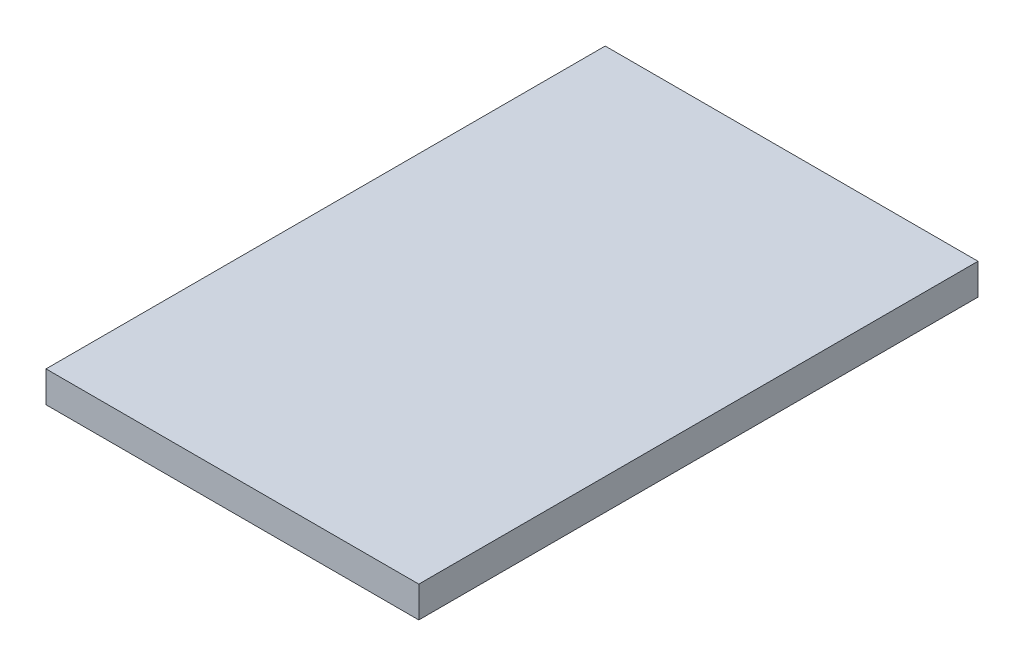
ISO-10303-21;
HEADER;
FILE_DESCRIPTION(('STEP AP214'),'2;1');
FILE_NAME('part.step','',(''),(''),'','','');
FILE_SCHEMA(('AUTOMOTIVE_DESIGN { 1 0 10303 214 1 1 1 1 }'));
ENDSEC;
DATA;
#1=APPLICATION_CONTEXT('core data for automotive mechanical design processes');
#2=APPLICATION_PROTOCOL_DEFINITION('international standard','automotive_design',2000,#1);
#3=PRODUCT_CONTEXT('',#1,'mechanical');
#4=PRODUCT('Part','Part','',(#3));
#5=PRODUCT_RELATED_PRODUCT_CATEGORY('part','',(#4));
#6=PRODUCT_DEFINITION_FORMATION('','',#4);
#7=PRODUCT_DEFINITION_CONTEXT('part definition',#1,'design');
#8=PRODUCT_DEFINITION('design','',#6,#7);
#9=PRODUCT_DEFINITION_SHAPE('','',#8);
#10=(LENGTH_UNIT() NAMED_UNIT(*) SI_UNIT(.MILLI.,.METRE.));
#11=(NAMED_UNIT(*) PLANE_ANGLE_UNIT() SI_UNIT($,.RADIAN.));
#12=(NAMED_UNIT(*) SI_UNIT($,.STERADIAN.) SOLID_ANGLE_UNIT());
#13=UNCERTAINTY_MEASURE_WITH_UNIT(LENGTH_MEASURE(1.E-05),#10,'distance_accuracy_value','');
#14=(GEOMETRIC_REPRESENTATION_CONTEXT(3) GLOBAL_UNCERTAINTY_ASSIGNED_CONTEXT((#13)) GLOBAL_UNIT_ASSIGNED_CONTEXT((#10,
#11,#12)) REPRESENTATION_CONTEXT('',''));
#15=CARTESIAN_POINT('',(0.,0.,0.));
#16=DIRECTION('',(0.,0.,1.));
#17=DIRECTION('',(1.,0.,0.));
#18=AXIS2_PLACEMENT_3D('',#15,#16,#17);
#19=CARTESIAN_POINT('',(152.4,-12.7,457.2));
#20=DIRECTION('',(-1.,0.,0.));
#21=DIRECTION('',(0.,0.,1.));
#22=AXIS2_PLACEMENT_3D('',#19,#20,#21);
#23=PLANE('',#22);
#24=DIRECTION('',(0.,1.,0.));
#25=VECTOR('',#24,1.);
#26=CARTESIAN_POINT('',(152.4,-12.7,0.));
#27=LINE('',#26,#25);
#28=CARTESIAN_POINT('',(152.4,-12.7,0.));
#29=VERTEX_POINT('',#28);
#30=CARTESIAN_POINT('',(152.4,12.7,0.));
#31=VERTEX_POINT('',#30);
#32=EDGE_CURVE('E107',#29,#31,#27,.T.);
#33=ORIENTED_EDGE('',*,*,#32,.T.);
#34=DIRECTION('',(0.,0.,-1.));
#35=VECTOR('',#34,1.);
#36=CARTESIAN_POINT('',(152.4,12.7,457.2));
#37=LINE('',#36,#35);
#38=CARTESIAN_POINT('',(152.4,12.7,457.2));
#39=VERTEX_POINT('',#38);
#40=EDGE_CURVE('E11',#39,#31,#37,.T.);
#41=ORIENTED_EDGE('',*,*,#40,.F.);
#42=DIRECTION('',(0.,1.,0.));
#43=VECTOR('',#42,1.);
#44=CARTESIAN_POINT('',(152.4,-12.7,457.2));
#45=LINE('',#44,#43);
#46=CARTESIAN_POINT('',(152.4,-12.7,457.2));
#47=VERTEX_POINT('',#46);
#48=EDGE_CURVE('E91',#47,#39,#45,.T.);
#49=ORIENTED_EDGE('',*,*,#48,.F.);
#50=DIRECTION('',(0.,0.,-1.));
#51=VECTOR('',#50,1.);
#52=CARTESIAN_POINT('',(152.4,-12.7,457.2));
#53=LINE('',#52,#51);
#54=EDGE_CURVE('E103',#47,#29,#53,.T.);
#55=ORIENTED_EDGE('',*,*,#54,.T.);
#56=EDGE_LOOP('',(#33,#41,#49,#55));
#57=FACE_BOUND('',#56,.T.);
#58=ADVANCED_FACE('F39',(#57),#23,.F.);
#59=CARTESIAN_POINT('',(-152.4,12.7,457.2));
#60=DIRECTION('',(0.,-1.,0.));
#61=DIRECTION('',(0.,0.,-1.));
#62=AXIS2_PLACEMENT_3D('',#59,#60,#61);
#63=PLANE('',#62);
#64=DIRECTION('',(-1.,0.,0.));
#65=VECTOR('',#64,1.);
#66=CARTESIAN_POINT('',(-152.4,12.7,0.));
#67=LINE('',#66,#65);
#68=CARTESIAN_POINT('',(-152.4,12.7,0.));
#69=VERTEX_POINT('',#68);
#70=EDGE_CURVE('E96',#31,#69,#67,.T.);
#71=ORIENTED_EDGE('',*,*,#70,.T.);
#72=DIRECTION('',(0.,0.,-1.));
#73=VECTOR('',#72,1.);
#74=CARTESIAN_POINT('',(-152.4,12.7,457.2));
#75=LINE('',#74,#73);
#76=CARTESIAN_POINT('',(-152.4,12.7,457.2));
#77=VERTEX_POINT('',#76);
#78=EDGE_CURVE('E48',#77,#69,#75,.T.);
#79=ORIENTED_EDGE('',*,*,#78,.F.);
#80=DIRECTION('',(-1.,0.,0.));
#81=VECTOR('',#80,1.);
#82=CARTESIAN_POINT('',(-152.4,12.7,457.2));
#83=LINE('',#82,#81);
#84=EDGE_CURVE('E86',#39,#77,#83,.T.);
#85=ORIENTED_EDGE('',*,*,#84,.F.);
#86=ORIENTED_EDGE('',*,*,#40,.T.);
#87=EDGE_LOOP('',(#71,#79,#85,#86));
#88=FACE_BOUND('',#87,.T.);
#89=ADVANCED_FACE('F95',(#88),#63,.F.);
#90=CARTESIAN_POINT('',(-152.4,-12.7,457.2));
#91=DIRECTION('',(1.,0.,0.));
#92=DIRECTION('',(0.,0.,-1.));
#93=AXIS2_PLACEMENT_3D('',#90,#91,#92);
#94=PLANE('',#93);
#95=DIRECTION('',(0.,-1.,0.));
#96=VECTOR('',#95,1.);
#97=CARTESIAN_POINT('',(-152.4,-12.7,0.));
#98=LINE('',#97,#96);
#99=CARTESIAN_POINT('',(-152.4,-12.7,0.));
#100=VERTEX_POINT('',#99);
#101=EDGE_CURVE('E73',#69,#100,#98,.T.);
#102=ORIENTED_EDGE('',*,*,#101,.T.);
#103=DIRECTION('',(0.,0.,-1.));
#104=VECTOR('',#103,1.);
#105=CARTESIAN_POINT('',(-152.4,-12.7,457.2));
#106=LINE('',#105,#104);
#107=CARTESIAN_POINT('',(-152.4,-12.7,457.2));
#108=VERTEX_POINT('',#107);
#109=EDGE_CURVE('E98',#108,#100,#106,.T.);
#110=ORIENTED_EDGE('',*,*,#109,.F.);
#111=DIRECTION('',(0.,-1.,0.));
#112=VECTOR('',#111,1.);
#113=CARTESIAN_POINT('',(-152.4,-12.7,457.2));
#114=LINE('',#113,#112);
#115=EDGE_CURVE('E89',#77,#108,#114,.T.);
#116=ORIENTED_EDGE('',*,*,#115,.F.);
#117=ORIENTED_EDGE('',*,*,#78,.T.);
#118=EDGE_LOOP('',(#102,#110,#116,#117));
#119=FACE_BOUND('',#118,.T.);
#120=ADVANCED_FACE('F99',(#119),#94,.F.);
#121=CARTESIAN_POINT('',(-152.4,-12.7,457.2));
#122=DIRECTION('',(0.,1.,0.));
#123=DIRECTION('',(0.,0.,1.));
#124=AXIS2_PLACEMENT_3D('',#121,#122,#123);
#125=PLANE('',#124);
#126=DIRECTION('',(1.,0.,0.));
#127=VECTOR('',#126,1.);
#128=CARTESIAN_POINT('',(-152.4,-12.7,0.));
#129=LINE('',#128,#127);
#130=EDGE_CURVE('E79',#100,#29,#129,.T.);
#131=ORIENTED_EDGE('',*,*,#130,.T.);
#132=ORIENTED_EDGE('',*,*,#54,.F.);
#133=DIRECTION('',(1.,0.,0.));
#134=VECTOR('',#133,1.);
#135=CARTESIAN_POINT('',(-152.4,-12.7,457.2));
#136=LINE('',#135,#134);
#137=EDGE_CURVE('E56',#108,#47,#136,.T.);
#138=ORIENTED_EDGE('',*,*,#137,.F.);
#139=ORIENTED_EDGE('',*,*,#109,.T.);
#140=EDGE_LOOP('',(#131,#132,#138,#139));
#141=FACE_BOUND('',#140,.T.);
#142=ADVANCED_FACE('F120',(#141),#125,.F.);
#143=CARTESIAN_POINT('',(0.,0.,457.2));
#144=DIRECTION('',(0.,0.,-1.));
#145=DIRECTION('',(-1.,0.,0.));
#146=AXIS2_PLACEMENT_3D('',#143,#144,#145);
#147=PLANE('',#146);
#148=ORIENTED_EDGE('',*,*,#48,.T.);
#149=ORIENTED_EDGE('',*,*,#84,.T.);
#150=ORIENTED_EDGE('',*,*,#115,.T.);
#151=ORIENTED_EDGE('',*,*,#137,.T.);
#152=EDGE_LOOP('',(#148,#149,#150,#151));
#153=FACE_BOUND('',#152,.T.);
#154=ADVANCED_FACE('F87',(#153),#147,.F.);
#155=CARTESIAN_POINT('',(0.,0.,0.));
#156=DIRECTION('',(0.,0.,-1.));
#157=DIRECTION('',(-1.,0.,0.));
#158=AXIS2_PLACEMENT_3D('',#155,#156,#157);
#159=PLANE('',#158);
#160=ORIENTED_EDGE('',*,*,#32,.F.);
#161=ORIENTED_EDGE('',*,*,#130,.F.);
#162=ORIENTED_EDGE('',*,*,#101,.F.);
#163=ORIENTED_EDGE('',*,*,#70,.F.);
#164=EDGE_LOOP('',(#160,#161,#162,#163));
#165=FACE_BOUND('',#164,.T.);
#166=ADVANCED_FACE('F123',(#165),#159,.T.);
#167=CLOSED_SHELL('',(#58,#89,#120,#142,#154,#166));
#168=MANIFOLD_SOLID_BREP('B2',#167);
#169=ADVANCED_BREP_SHAPE_REPRESENTATION('',(#18,#168),#14);
#170=SHAPE_DEFINITION_REPRESENTATION(#9,#169);
ENDSEC;
END-ISO-10303-21;
